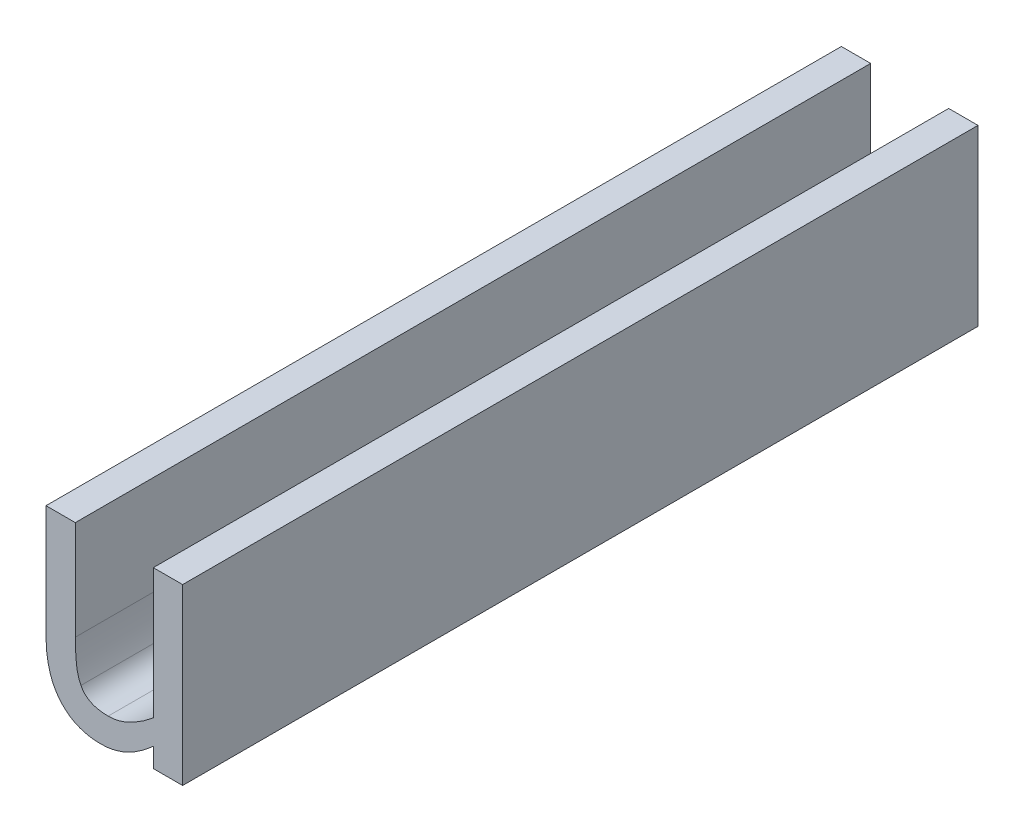
ISO-10303-21;
HEADER;
FILE_DESCRIPTION(('STEP AP214'),'2;1');
FILE_NAME('part.step','',(''),(''),'','','');
FILE_SCHEMA(('AUTOMOTIVE_DESIGN { 1 0 10303 214 1 1 1 1 }'));
ENDSEC;
DATA;
#1=APPLICATION_CONTEXT('core data for automotive mechanical design processes');
#2=APPLICATION_PROTOCOL_DEFINITION('international standard','automotive_design',2000,#1);
#3=PRODUCT_CONTEXT('',#1,'mechanical');
#4=PRODUCT('Part','Part','',(#3));
#5=PRODUCT_RELATED_PRODUCT_CATEGORY('part','',(#4));
#6=PRODUCT_DEFINITION_FORMATION('','',#4);
#7=PRODUCT_DEFINITION_CONTEXT('part definition',#1,'design');
#8=PRODUCT_DEFINITION('design','',#6,#7);
#9=PRODUCT_DEFINITION_SHAPE('','',#8);
#10=(LENGTH_UNIT() NAMED_UNIT(*) SI_UNIT(.MILLI.,.METRE.));
#11=(NAMED_UNIT(*) PLANE_ANGLE_UNIT() SI_UNIT($,.RADIAN.));
#12=(NAMED_UNIT(*) SI_UNIT($,.STERADIAN.) SOLID_ANGLE_UNIT());
#13=UNCERTAINTY_MEASURE_WITH_UNIT(LENGTH_MEASURE(1.E-05),#10,'distance_accuracy_value','');
#14=(GEOMETRIC_REPRESENTATION_CONTEXT(3) GLOBAL_UNCERTAINTY_ASSIGNED_CONTEXT((#13)) GLOBAL_UNIT_ASSIGNED_CONTEXT((#10,
#11,#12)) REPRESENTATION_CONTEXT('',''));
#15=CARTESIAN_POINT('',(0.,0.,0.));
#16=DIRECTION('',(0.,0.,1.));
#17=DIRECTION('',(1.,0.,0.));
#18=AXIS2_PLACEMENT_3D('',#15,#16,#17);
#19=CARTESIAN_POINT('',(5.132988807721,3.57537755009,0.));
#20=DIRECTION('',(0.,1.,0.));
#21=DIRECTION('',(0.,0.,1.));
#22=AXIS2_PLACEMENT_3D('',#19,#20,#21);
#23=PLANE('',#22);
#24=DIRECTION('',(1.,0.,0.));
#25=VECTOR('',#24,1.);
#26=CARTESIAN_POINT('',(5.138448572485,3.57537755009,0.1));
#27=LINE('',#26,#25);
#28=CARTESIAN_POINT('',(5.132988807721,3.57537755009,0.1));
#29=VERTEX_POINT('',#28);
#30=CARTESIAN_POINT('',(5.129302453996,3.57537755009,0.1));
#31=VERTEX_POINT('',#30);
#32=EDGE_CURVE('E290',#29,#31,#27,.F.);
#33=ORIENTED_EDGE('',*,*,#32,.F.);
#34=DIRECTION('',(0.,0.,-1.));
#35=VECTOR('',#34,1.);
#36=CARTESIAN_POINT('',(5.132988807721,3.57537755009,0.));
#37=LINE('',#36,#35);
#38=CARTESIAN_POINT('',(5.132988807721,3.57537755009,0.));
#39=VERTEX_POINT('',#38);
#40=EDGE_CURVE('E284',#39,#29,#37,.F.);
#41=ORIENTED_EDGE('',*,*,#40,.F.);
#42=DIRECTION('',(1.,0.,0.));
#43=VECTOR('',#42,1.);
#44=CARTESIAN_POINT('',(5.138448572485,3.57537755009,0.));
#45=LINE('',#44,#43);
#46=CARTESIAN_POINT('',(5.129302453996,3.57537755009,0.));
#47=VERTEX_POINT('',#46);
#48=EDGE_CURVE('E255',#39,#47,#45,.F.);
#49=ORIENTED_EDGE('',*,*,#48,.T.);
#50=DIRECTION('',(0.,0.,1.));
#51=VECTOR('',#50,1.);
#52=CARTESIAN_POINT('',(5.129302453996,3.57537755009,0.));
#53=LINE('',#52,#51);
#54=EDGE_CURVE('E296',#31,#47,#53,.F.);
#55=ORIENTED_EDGE('',*,*,#54,.F.);
#56=EDGE_LOOP('',(#33,#41,#49,#55));
#57=FACE_BOUND('',#56,.T.);
#58=ADVANCED_FACE('F17',(#57),#23,.T.);
#59=CARTESIAN_POINT('',(5.129302453996,3.57537755009,0.));
#60=DIRECTION('',(-1.,0.,0.));
#61=DIRECTION('',(0.,0.,1.));
#62=AXIS2_PLACEMENT_3D('',#59,#60,#61);
#63=PLANE('',#62);
#64=DIRECTION('',(0.,1.,0.));
#65=VECTOR('',#64,1.);
#66=CARTESIAN_POINT('',(5.129302453996,3.564120544912,0.1));
#67=LINE('',#66,#65);
#68=CARTESIAN_POINT('',(5.129302453996,3.561175636063,0.1));
#69=VERTEX_POINT('',#68);
#70=EDGE_CURVE('E293',#31,#69,#67,.F.);
#71=ORIENTED_EDGE('',*,*,#70,.F.);
#72=ORIENTED_EDGE('',*,*,#54,.T.);
#73=DIRECTION('',(0.,1.,0.));
#74=VECTOR('',#73,1.);
#75=CARTESIAN_POINT('',(5.129302453996,3.564120544912,0.));
#76=LINE('',#75,#74);
#77=CARTESIAN_POINT('',(5.129302453996,3.561175636063,0.));
#78=VERTEX_POINT('',#77);
#79=EDGE_CURVE('E118',#47,#78,#76,.F.);
#80=ORIENTED_EDGE('',*,*,#79,.T.);
#81=DIRECTION('',(0.,0.,-1.));
#82=VECTOR('',#81,1.);
#83=CARTESIAN_POINT('',(5.129302453996,3.561175636063,0.05));
#84=LINE('',#83,#82);
#85=EDGE_CURVE('E128',#69,#78,#84,.T.);
#86=ORIENTED_EDGE('',*,*,#85,.F.);
#87=EDGE_LOOP('',(#71,#72,#80,#86));
#88=FACE_BOUND('',#87,.T.);
#89=ADVANCED_FACE('F371',(#88),#63,.T.);
#90=CARTESIAN_POINT('',(5.129302453996,3.561175636063,0.));
#91=CARTESIAN_POINT('',(5.129302453996,3.561175636063,0.1));
#92=CARTESIAN_POINT('',(5.129302453996,3.557134825249,0.));
#93=CARTESIAN_POINT('',(5.129302453996,3.557134825249,0.1));
#94=CARTESIAN_POINT('',(5.132941546775,3.552881340183,0.));
#95=CARTESIAN_POINT('',(5.132941546775,3.552881340183,0.1));
#96=CARTESIAN_POINT('',(5.136155291048,3.552881340183,0.));
#97=CARTESIAN_POINT('',(5.136155291048,3.552881340183,0.1));
#98=B_SPLINE_SURFACE_WITH_KNOTS('',2,1,((#90,#91),(#92,#93),(#94,#95),(#96,#97)),.UNSPECIFIED.,
.F.,.F.,.F.,(3,1,3),(2,2),(-2.,-1.,0.),(0.,0.01),.UNSPECIFIED.);
#99=CARTESIAN_POINT('',(5.129302453996,3.561175636063,0.1));
#100=CARTESIAN_POINT('',(5.12930371119374,3.56055458030454,0.1));
#101=CARTESIAN_POINT('',(5.12933499163837,3.55992389001481,0.1));
#102=CARTESIAN_POINT('',(5.12951230763813,3.55850561337949,0.1));
#103=CARTESIAN_POINT('',(5.12968701161501,3.55772157660612,0.1));
#104=CARTESIAN_POINT('',(5.13011180367962,3.55661260737521,0.1));
#105=CARTESIAN_POINT('',(5.13027860269103,3.55625666040931,0.1));
#106=CARTESIAN_POINT('',(5.13083173349762,3.55531274969201,0.1));
#107=CARTESIAN_POINT('',(5.13128764272219,3.55476176481285,0.1));
#108=CARTESIAN_POINT('',(5.13208511764289,3.55408984745094,0.1));
#109=CARTESIAN_POINT('',(5.13236566638977,3.55389318340302,0.1));
#110=CARTESIAN_POINT('',(5.13323473102865,3.55339676221626,0.1));
#111=CARTESIAN_POINT('',(5.13386634659164,3.55317203646916,0.1));
#112=CARTESIAN_POINT('',(5.13505767659058,3.55292532100791,0.1));
#113=CARTESIAN_POINT('',(5.13561171197699,3.55287567639697,0.1));
#114=CARTESIAN_POINT('',(5.136155291048,3.552881340183,0.1));
#115=B_SPLINE_CURVE_WITH_KNOTS('',3,(#99,#100,#101,#102,#103,#104,#105,#106,#107,#108,#109,#110,
#111,#112,#113,#114),.UNSPECIFIED.,.F.,.F.,(4,2,2,2,2,2,2,4),(0.,0.00187989626495652,
0.00426669008843733,0.00544185041958465,0.00753867902056661,0.00856165204487438,
0.010539149434339,0.0121853916043969),.UNSPECIFIED.);
#116=CARTESIAN_POINT('',(5.136155291048,3.552881340183,0.1));
#117=VERTEX_POINT('',#116);
#118=EDGE_CURVE('E191',#69,#117,#115,.T.);
#119=CARTESIAN_POINT('',(5.129302453996,3.561175636063,0.));
#120=CARTESIAN_POINT('',(5.12930371119374,3.56055458030454,0.));
#121=CARTESIAN_POINT('',(5.12933499163837,3.55992389001481,0.));
#122=CARTESIAN_POINT('',(5.12951230763813,3.55850561337949,0.));
#123=CARTESIAN_POINT('',(5.12968701161501,3.55772157660612,0.));
#124=CARTESIAN_POINT('',(5.13011180367962,3.55661260737521,0.));
#125=CARTESIAN_POINT('',(5.13027860269103,3.55625666040931,0.));
#126=CARTESIAN_POINT('',(5.13083173349762,3.55531274969201,0.));
#127=CARTESIAN_POINT('',(5.13128764272219,3.55476176481285,0.));
#128=CARTESIAN_POINT('',(5.13208511764289,3.55408984745094,0.));
#129=CARTESIAN_POINT('',(5.13236566638977,3.55389318340302,0.));
#130=CARTESIAN_POINT('',(5.13323473102865,3.55339676221626,0.));
#131=CARTESIAN_POINT('',(5.13386634659164,3.55317203646916,0.));
#132=CARTESIAN_POINT('',(5.13505767659058,3.55292532100791,0.));
#133=CARTESIAN_POINT('',(5.13561171197699,3.55287567639697,0.));
#134=CARTESIAN_POINT('',(5.136155291048,3.552881340183,0.));
#135=B_SPLINE_CURVE_WITH_KNOTS('',3,(#119,#120,#121,#122,#123,#124,#125,#126,#127,#128,#129,
#130,#131,#132,#133,#134),.UNSPECIFIED.,.F.,.F.,(4,2,2,2,2,2,2,4),(0.,0.00187989626495652,
0.00426669008843733,0.00544185041958465,0.00753867902056661,0.00856165204487438,
0.010539149434339,0.0121853916043969),.UNSPECIFIED.);
#136=CARTESIAN_POINT('',(5.136155291048,3.552881340183,0.));
#137=VERTEX_POINT('',#136);
#138=EDGE_CURVE('E24',#78,#137,#135,.T.);
#139=DIRECTION('',(0.,0.,-1.));
#140=VECTOR('',#139,1.);
#141=CARTESIAN_POINT('',(5.136155291048,3.552881340183,0.05));
#142=LINE('',#141,#140);
#143=EDGE_CURVE('E126',#117,#137,#142,.T.);
#144=ORIENTED_EDGE('',*,*,#118,.F.);
#145=ORIENTED_EDGE('',*,*,#85,.T.);
#146=ORIENTED_EDGE('',*,*,#138,.T.);
#147=ORIENTED_EDGE('',*,*,#143,.F.);
#148=EDGE_LOOP('',(#144,#145,#146,#147));
#149=FACE_BOUND('',#148,.T.);
#150=ADVANCED_FACE('F125',(#149),#98,.T.);
#151=CARTESIAN_POINT('',(5.136155291048,3.552881340183,0.));
#152=CARTESIAN_POINT('',(5.136155291048,3.552881340183,0.1));
#153=CARTESIAN_POINT('',(5.137951206965,3.552881340183,0.));
#154=CARTESIAN_POINT('',(5.137951206965,3.552881340183,0.1));
#155=CARTESIAN_POINT('',(5.141141320765,3.554440951374,0.));
#156=CARTESIAN_POINT('',(5.141141320765,3.554440951374,0.1));
#157=CARTESIAN_POINT('',(5.142795453846,3.555929671147,0.));
#158=CARTESIAN_POINT('',(5.142795453846,3.555929671147,0.1));
#159=B_SPLINE_SURFACE_WITH_KNOTS('',2,1,((#151,#152),(#153,#154),(#155,#156),(#157,#158)),
.UNSPECIFIED.,.F.,.F.,.F.,(3,1,3),(2,2),(-2.,-1.,0.),(0.,0.01),.UNSPECIFIED.);
#160=CARTESIAN_POINT('',(5.136155291048,3.552881340183,0.1));
#161=CARTESIAN_POINT('',(5.13678853026826,3.55286714268251,0.1));
#162=CARTESIAN_POINT('',(5.13741442870382,3.552948742182,0.1));
#163=CARTESIAN_POINT('',(5.13862924326214,3.55326152794095,0.1));
#164=CARTESIAN_POINT('',(5.13921815738917,3.55349272226516,0.1));
#165=CARTESIAN_POINT('',(5.14033664789793,3.554062692285,0.1));
#166=CARTESIAN_POINT('',(5.14086622232563,3.55440147152194,0.1));
#167=CARTESIAN_POINT('',(5.14186685951062,3.55513425373084,0.1));
#168=CARTESIAN_POINT('',(5.14233903900896,3.55552669798045,0.1));
#169=CARTESIAN_POINT('',(5.142795453846,3.555929671147,0.1));
#170=B_SPLINE_CURVE_WITH_KNOTS('',3,(#160,#161,#162,#163,#164,#165,#166,#167,#168,#169),
.UNSPECIFIED.,.F.,.F.,(4,2,2,2,4),(0.,0.00187989657440297,0.00375989450365635,
0.00563995432227521,0.00747389016123619),.UNSPECIFIED.);
#171=CARTESIAN_POINT('',(5.142795453846,3.555929671147,0.1));
#172=VERTEX_POINT('',#171);
#173=EDGE_CURVE('E136',#117,#172,#170,.T.);
#174=CARTESIAN_POINT('',(5.136155291048,3.552881340183,0.));
#175=CARTESIAN_POINT('',(5.13678853026826,3.55286714268251,0.));
#176=CARTESIAN_POINT('',(5.13741442870382,3.552948742182,0.));
#177=CARTESIAN_POINT('',(5.13862924326214,3.55326152794095,0.));
#178=CARTESIAN_POINT('',(5.13921815738917,3.55349272226516,0.));
#179=CARTESIAN_POINT('',(5.14033664789793,3.554062692285,0.));
#180=CARTESIAN_POINT('',(5.14086622232563,3.55440147152194,0.));
#181=CARTESIAN_POINT('',(5.14186685951062,3.55513425373084,0.));
#182=CARTESIAN_POINT('',(5.14233903900896,3.55552669798045,0.));
#183=CARTESIAN_POINT('',(5.142795453846,3.555929671147,0.));
#184=B_SPLINE_CURVE_WITH_KNOTS('',3,(#174,#175,#176,#177,#178,#179,#180,#181,#182,#183),
.UNSPECIFIED.,.F.,.F.,(4,2,2,2,4),(0.,0.00187989657440297,0.00375989450365635,
0.00563995432227521,0.00747389016123619),.UNSPECIFIED.);
#185=CARTESIAN_POINT('',(5.142795453846,3.555929671147,0.));
#186=VERTEX_POINT('',#185);
#187=EDGE_CURVE('E131',#137,#186,#184,.T.);
#188=DIRECTION('',(0.,0.,1.));
#189=VECTOR('',#188,1.);
#190=CARTESIAN_POINT('',(5.142795453846,3.555929671147,0.));
#191=LINE('',#190,#189);
#192=EDGE_CURVE('E299',#172,#186,#191,.F.);
#193=ORIENTED_EDGE('',*,*,#173,.F.);
#194=ORIENTED_EDGE('',*,*,#143,.T.);
#195=ORIENTED_EDGE('',*,*,#187,.T.);
#196=ORIENTED_EDGE('',*,*,#192,.F.);
#197=EDGE_LOOP('',(#193,#194,#195,#196));
#198=FACE_BOUND('',#197,.T.);
#199=ADVANCED_FACE('F133',(#198),#159,.T.);
#200=CARTESIAN_POINT('',(5.142795453846,3.57537755009,0.));
#201=DIRECTION('',(-1.,0.,0.));
#202=DIRECTION('',(0.,0.,1.));
#203=AXIS2_PLACEMENT_3D('',#200,#201,#202);
#204=PLANE('',#203);
#205=DIRECTION('',(0.,1.,0.));
#206=VECTOR('',#205,1.);
#207=CARTESIAN_POINT('',(5.142795453846,3.564120544912,0.1));
#208=LINE('',#207,#206);
#209=CARTESIAN_POINT('',(5.142795453846,3.57537755009,0.1));
#210=VERTEX_POINT('',#209);
#211=CARTESIAN_POINT('',(5.142795453846,3.559025263057,0.1));
#212=VERTEX_POINT('',#211);
#213=EDGE_CURVE('E318',#210,#212,#208,.F.);
#214=ORIENTED_EDGE('',*,*,#213,.F.);
#215=DIRECTION('',(0.,0.,1.));
#216=VECTOR('',#215,1.);
#217=CARTESIAN_POINT('',(5.142795453846,3.57537755009,0.));
#218=LINE('',#217,#216);
#219=CARTESIAN_POINT('',(5.142795453846,3.57537755009,0.));
#220=VERTEX_POINT('',#219);
#221=EDGE_CURVE('E281',#220,#210,#218,.T.);
#222=ORIENTED_EDGE('',*,*,#221,.F.);
#223=DIRECTION('',(0.,1.,0.));
#224=VECTOR('',#223,1.);
#225=CARTESIAN_POINT('',(5.142795453846,3.564120544912,0.));
#226=LINE('',#225,#224);
#227=CARTESIAN_POINT('',(5.142795453846,3.559025263057,0.));
#228=VERTEX_POINT('',#227);
#229=EDGE_CURVE('E145',#220,#228,#226,.F.);
#230=ORIENTED_EDGE('',*,*,#229,.T.);
#231=DIRECTION('',(0.,0.,-1.));
#232=VECTOR('',#231,1.);
#233=CARTESIAN_POINT('',(5.142795453846,3.559025263057,0.05));
#234=LINE('',#233,#232);
#235=EDGE_CURVE('E138',#212,#228,#234,.T.);
#236=ORIENTED_EDGE('',*,*,#235,.F.);
#237=EDGE_LOOP('',(#214,#222,#230,#236));
#238=FACE_BOUND('',#237,.T.);
#239=ADVANCED_FACE('F167',(#238),#204,.T.);
#240=CARTESIAN_POINT('',(5.142795453846,3.559025263057,0.));
#241=CARTESIAN_POINT('',(5.142795453846,3.559025263057,0.1));
#242=CARTESIAN_POINT('',(5.141401255963,3.557843739427,0.));
#243=CARTESIAN_POINT('',(5.141401255963,3.557843739427,0.1));
#244=CARTESIAN_POINT('',(5.138494707834,3.556378650126,0.));
#245=CARTESIAN_POINT('',(5.138494707834,3.556378650126,0.1));
#246=CARTESIAN_POINT('',(5.137124140424,3.556378650126,0.));
#247=CARTESIAN_POINT('',(5.137124140424,3.556378650126,0.1));
#248=B_SPLINE_SURFACE_WITH_KNOTS('',2,1,((#240,#241),(#242,#243),(#244,#245),(#246,#247)),
.UNSPECIFIED.,.F.,.F.,.F.,(3,1,3),(2,2),(-2.,-1.,0.),(0.,0.01),.UNSPECIFIED.);
#249=CARTESIAN_POINT('',(5.142795453846,3.559025263057,0.1));
#250=CARTESIAN_POINT('',(5.14244519238062,3.55872772923515,0.1));
#251=CARTESIAN_POINT('',(5.14208309075724,3.55844482418846,0.1));
#252=CARTESIAN_POINT('',(5.14133501977179,3.55791340611258,0.1));
#253=CARTESIAN_POINT('',(5.14094907119075,3.55766486373352,0.1));
#254=CARTESIAN_POINT('',(5.14015175684747,3.55720633916023,0.1));
#255=CARTESIAN_POINT('',(5.13974034388833,3.55699643161847,0.1));
#256=CARTESIAN_POINT('',(5.13862452545305,3.55654752174504,0.1));
#257=CARTESIAN_POINT('',(5.13789695304588,3.5563715318818,0.1));
#258=CARTESIAN_POINT('',(5.137124140424,3.556378650126,0.1));
#259=B_SPLINE_CURVE_WITH_KNOTS('',3,(#249,#250,#251,#252,#253,#254,#255,#256,#257,#258),
.UNSPECIFIED.,.F.,.F.,(4,2,2,2,4),(0.,0.0013772330628118,0.00275328243786522,
0.00413196340457667,0.00636758689292962),.UNSPECIFIED.);
#260=CARTESIAN_POINT('',(5.137124140424,3.556378650126,0.1));
#261=VERTEX_POINT('',#260);
#262=EDGE_CURVE('E192',#212,#261,#259,.T.);
#263=CARTESIAN_POINT('',(5.142795453846,3.559025263057,0.));
#264=CARTESIAN_POINT('',(5.14244519238062,3.55872772923515,0.));
#265=CARTESIAN_POINT('',(5.14208309075724,3.55844482418846,0.));
#266=CARTESIAN_POINT('',(5.14133501977179,3.55791340611258,0.));
#267=CARTESIAN_POINT('',(5.14094907119075,3.55766486373352,0.));
#268=CARTESIAN_POINT('',(5.14015175684747,3.55720633916023,0.));
#269=CARTESIAN_POINT('',(5.13974034388833,3.55699643161847,0.));
#270=CARTESIAN_POINT('',(5.13862452545305,3.55654752174504,0.));
#271=CARTESIAN_POINT('',(5.13789695304588,3.5563715318818,0.));
#272=CARTESIAN_POINT('',(5.137124140424,3.556378650126,0.));
#273=B_SPLINE_CURVE_WITH_KNOTS('',3,(#263,#264,#265,#266,#267,#268,#269,#270,#271,#272),
.UNSPECIFIED.,.F.,.F.,(4,2,2,2,4),(0.,0.0013772330628118,0.00275328243786522,
0.00413196340457667,0.00636758689292962),.UNSPECIFIED.);
#274=CARTESIAN_POINT('',(5.137124140424,3.556378650126,0.));
#275=VERTEX_POINT('',#274);
#276=EDGE_CURVE('E153',#228,#275,#273,.T.);
#277=DIRECTION('',(0.,0.,-1.));
#278=VECTOR('',#277,1.);
#279=CARTESIAN_POINT('',(5.137124140424,3.556378650126,0.05));
#280=LINE('',#279,#278);
#281=EDGE_CURVE('E325',#261,#275,#280,.T.);
#282=ORIENTED_EDGE('',*,*,#262,.F.);
#283=ORIENTED_EDGE('',*,*,#235,.T.);
#284=ORIENTED_EDGE('',*,*,#276,.T.);
#285=ORIENTED_EDGE('',*,*,#281,.F.);
#286=EDGE_LOOP('',(#282,#283,#284,#285));
#287=FACE_BOUND('',#286,.T.);
#288=ADVANCED_FACE('F172',(#287),#248,.T.);
#289=CARTESIAN_POINT('',(5.137124140424,3.556378650126,0.));
#290=CARTESIAN_POINT('',(5.137124140424,3.556378650126,0.1));
#291=CARTESIAN_POINT('',(5.135753573014,3.556378650126,0.));
#292=CARTESIAN_POINT('',(5.135753573014,3.556378650126,0.1));
#293=CARTESIAN_POINT('',(5.134146700877,3.557182086195,0.));
#294=CARTESIAN_POINT('',(5.134146700877,3.557182086195,0.1));
#295=CARTESIAN_POINT('',(5.133697721898,3.558009152735,0.));
#296=CARTESIAN_POINT('',(5.133697721898,3.558009152735,0.1));
#297=B_SPLINE_SURFACE_WITH_KNOTS('',2,1,((#289,#290),(#291,#292),(#293,#294),(#295,#296)),
.UNSPECIFIED.,.F.,.F.,.F.,(3,1,3),(2,2),(-2.,-1.,0.),(0.,0.01),.UNSPECIFIED.);
#298=CARTESIAN_POINT('',(5.137124140424,3.556378650126,0.1));
#299=CARTESIAN_POINT('',(5.13667358884304,3.55636709332848,0.1));
#300=CARTESIAN_POINT('',(5.13619540544661,3.55640332720978,0.1));
#301=CARTESIAN_POINT('',(5.13538846766422,3.55659311451495,0.1));
#302=CARTESIAN_POINT('',(5.13505124464535,3.55671667754426,0.1));
#303=CARTESIAN_POINT('',(5.13430743322107,3.55714566300273,0.1));
#304=CARTESIAN_POINT('',(5.13393649384337,3.55750746239232,0.1));
#305=CARTESIAN_POINT('',(5.133697721898,3.558009152735,0.1));
#306=B_SPLINE_CURVE_WITH_KNOTS('',3,(#298,#299,#300,#301,#302,#303,#304,#305),.UNSPECIFIED.,.F.,
.F.,(4,2,2,4),(0.,0.00139303844047665,0.00245436902179683,0.0039867848779766),.UNSPECIFIED.);
#307=CARTESIAN_POINT('',(5.133697721898,3.558009152735,0.1));
#308=VERTEX_POINT('',#307);
#309=EDGE_CURVE('E221',#261,#308,#306,.T.);
#310=CARTESIAN_POINT('',(5.137124140424,3.556378650126,0.));
#311=CARTESIAN_POINT('',(5.13667358884304,3.55636709332848,0.));
#312=CARTESIAN_POINT('',(5.13619540544661,3.55640332720978,0.));
#313=CARTESIAN_POINT('',(5.13538846766422,3.55659311451495,0.));
#314=CARTESIAN_POINT('',(5.13505124464535,3.55671667754426,0.));
#315=CARTESIAN_POINT('',(5.13430743322107,3.55714566300273,0.));
#316=CARTESIAN_POINT('',(5.13393649384337,3.55750746239232,0.));
#317=CARTESIAN_POINT('',(5.133697721898,3.558009152735,0.));
#318=B_SPLINE_CURVE_WITH_KNOTS('',3,(#310,#311,#312,#313,#314,#315,#316,#317),.UNSPECIFIED.,.F.,
.F.,(4,2,2,4),(0.,0.00139303844047665,0.00245436902179683,0.0039867848779766),.UNSPECIFIED.);
#319=CARTESIAN_POINT('',(5.133697721898,3.558009152735,0.));
#320=VERTEX_POINT('',#319);
#321=EDGE_CURVE('E239',#275,#320,#318,.T.);
#322=DIRECTION('',(0.,0.,-1.));
#323=VECTOR('',#322,1.);
#324=CARTESIAN_POINT('',(5.133697721898,3.558009152735,0.05));
#325=LINE('',#324,#323);
#326=EDGE_CURVE('E287',#308,#320,#325,.T.);
#327=ORIENTED_EDGE('',*,*,#309,.F.);
#328=ORIENTED_EDGE('',*,*,#281,.T.);
#329=ORIENTED_EDGE('',*,*,#321,.T.);
#330=ORIENTED_EDGE('',*,*,#326,.F.);
#331=EDGE_LOOP('',(#327,#328,#329,#330));
#332=FACE_BOUND('',#331,.T.);
#333=ADVANCED_FACE('F227',(#332),#297,.T.);
#334=CARTESIAN_POINT('',(5.133697721898,3.558009152735,0.));
#335=CARTESIAN_POINT('',(5.133697721898,3.558009152735,0.1));
#336=CARTESIAN_POINT('',(5.133272373392,3.558788958331,0.));
#337=CARTESIAN_POINT('',(5.133272373392,3.558788958331,0.1));
#338=CARTESIAN_POINT('',(5.132988807721,3.561388310316,0.));
#339=CARTESIAN_POINT('',(5.132988807721,3.561388310316,0.1));
#340=CARTESIAN_POINT('',(5.132988807721,3.562900660562,0.));
#341=CARTESIAN_POINT('',(5.132988807721,3.562900660562,0.1));
#342=B_SPLINE_SURFACE_WITH_KNOTS('',2,1,((#334,#335),(#336,#337),(#338,#339),(#340,#341)),
.UNSPECIFIED.,.F.,.F.,.F.,(3,1,3),(2,2),(-2.,-1.,0.),(0.,0.01),.UNSPECIFIED.);
#343=CARTESIAN_POINT('',(5.133697721898,3.558009152735,0.1));
#344=CARTESIAN_POINT('',(5.13350990597719,3.55836759859004,0.1));
#345=CARTESIAN_POINT('',(5.1333813897563,3.55874331963218,0.1));
#346=CARTESIAN_POINT('',(5.13316888410804,3.55964116543192,0.1));
#347=CARTESIAN_POINT('',(5.13311366025217,3.56017062737246,0.1));
#348=CARTESIAN_POINT('',(5.13304214987287,3.56109465479451,0.1));
#349=CARTESIAN_POINT('',(5.13301957885176,3.56148983401523,0.1));
#350=CARTESIAN_POINT('',(5.13299362819012,3.56222329852457,0.1));
#351=CARTESIAN_POINT('',(5.13298793150218,3.56256148414579,0.1));
#352=CARTESIAN_POINT('',(5.132988807721,3.562900660562,0.1));
#353=B_SPLINE_CURVE_WITH_KNOTS('',3,(#343,#344,#345,#346,#347,#348,#349,#350,#351,#352),
.UNSPECIFIED.,.F.,.F.,(4,2,2,2,4),(0.,0.00119127993804618,0.00277638468230773,
0.00396498136241607,0.00498039838102392),.UNSPECIFIED.);
#354=CARTESIAN_POINT('',(5.132988807721,3.562900660562,0.1));
#355=VERTEX_POINT('',#354);
#356=EDGE_CURVE('E215',#308,#355,#353,.T.);
#357=CARTESIAN_POINT('',(5.133697721898,3.558009152735,0.));
#358=CARTESIAN_POINT('',(5.13350990597719,3.55836759859004,0.));
#359=CARTESIAN_POINT('',(5.1333813897563,3.55874331963218,0.));
#360=CARTESIAN_POINT('',(5.13316888410804,3.55964116543192,0.));
#361=CARTESIAN_POINT('',(5.13311366025217,3.56017062737246,0.));
#362=CARTESIAN_POINT('',(5.13304214987287,3.56109465479451,0.));
#363=CARTESIAN_POINT('',(5.13301957885176,3.56148983401523,0.));
#364=CARTESIAN_POINT('',(5.13299362819012,3.56222329852457,0.));
#365=CARTESIAN_POINT('',(5.13298793150218,3.56256148414579,0.));
#366=CARTESIAN_POINT('',(5.132988807721,3.562900660562,0.));
#367=B_SPLINE_CURVE_WITH_KNOTS('',3,(#357,#358,#359,#360,#361,#362,#363,#364,#365,#366),
.UNSPECIFIED.,.F.,.F.,(4,2,2,2,4),(0.,0.00119127993804618,0.00277638468230773,
0.00396498136241607,0.00498039838102392),.UNSPECIFIED.);
#368=CARTESIAN_POINT('',(5.132988807721,3.562900660562,0.));
#369=VERTEX_POINT('',#368);
#370=EDGE_CURVE('E244',#320,#369,#367,.T.);
#371=DIRECTION('',(0.,0.,-1.));
#372=VECTOR('',#371,1.);
#373=CARTESIAN_POINT('',(5.132988807721,3.562900660562,0.));
#374=LINE('',#373,#372);
#375=EDGE_CURVE('E286',#355,#369,#374,.T.);
#376=ORIENTED_EDGE('',*,*,#356,.F.);
#377=ORIENTED_EDGE('',*,*,#326,.T.);
#378=ORIENTED_EDGE('',*,*,#370,.T.);
#379=ORIENTED_EDGE('',*,*,#375,.F.);
#380=EDGE_LOOP('',(#376,#377,#378,#379));
#381=FACE_BOUND('',#380,.T.);
#382=ADVANCED_FACE('F19',(#381),#342,.T.);
#383=CARTESIAN_POINT('',(5.132988807721,3.562900660562,0.));
#384=DIRECTION('',(1.,0.,0.));
#385=DIRECTION('',(0.,0.,-1.));
#386=AXIS2_PLACEMENT_3D('',#383,#384,#385);
#387=PLANE('',#386);
#388=DIRECTION('',(0.,1.,0.));
#389=VECTOR('',#388,1.);
#390=CARTESIAN_POINT('',(5.132988807721,3.564120544912,0.1));
#391=LINE('',#390,#389);
#392=EDGE_CURVE('E331',#355,#29,#391,.T.);
#393=ORIENTED_EDGE('',*,*,#392,.F.);
#394=ORIENTED_EDGE('',*,*,#375,.T.);
#395=DIRECTION('',(0.,1.,0.));
#396=VECTOR('',#395,1.);
#397=CARTESIAN_POINT('',(5.132988807721,3.564120544912,0.));
#398=LINE('',#397,#396);
#399=EDGE_CURVE('E249',#369,#39,#398,.T.);
#400=ORIENTED_EDGE('',*,*,#399,.T.);
#401=ORIENTED_EDGE('',*,*,#40,.T.);
#402=EDGE_LOOP('',(#393,#394,#400,#401));
#403=FACE_BOUND('',#402,.T.);
#404=ADVANCED_FACE('F368',(#403),#387,.T.);
#405=CARTESIAN_POINT('',(5.142795453846,3.555929671147,0.));
#406=DIRECTION('',(-1.,0.,0.));
#407=DIRECTION('',(0.,0.,1.));
#408=AXIS2_PLACEMENT_3D('',#405,#406,#407);
#409=PLANE('',#408);
#410=DIRECTION('',(0.,1.,0.));
#411=VECTOR('',#410,1.);
#412=CARTESIAN_POINT('',(5.142795453846,3.564120544912,0.1));
#413=LINE('',#412,#411);
#414=CARTESIAN_POINT('',(5.142795453846,3.55349573247,0.1));
#415=VERTEX_POINT('',#414);
#416=EDGE_CURVE('E190',#172,#415,#413,.F.);
#417=ORIENTED_EDGE('',*,*,#416,.F.);
#418=ORIENTED_EDGE('',*,*,#192,.T.);
#419=DIRECTION('',(0.,1.,0.));
#420=VECTOR('',#419,1.);
#421=CARTESIAN_POINT('',(5.142795453846,3.564120544912,0.));
#422=LINE('',#421,#420);
#423=CARTESIAN_POINT('',(5.142795453846,3.55349573247,0.));
#424=VERTEX_POINT('',#423);
#425=EDGE_CURVE('E144',#186,#424,#422,.F.);
#426=ORIENTED_EDGE('',*,*,#425,.T.);
#427=DIRECTION('',(0.,0.,-1.));
#428=VECTOR('',#427,1.);
#429=CARTESIAN_POINT('',(5.142795453846,3.55349573247,0.));
#430=LINE('',#429,#428);
#431=EDGE_CURVE('E273',#415,#424,#430,.T.);
#432=ORIENTED_EDGE('',*,*,#431,.F.);
#433=EDGE_LOOP('',(#417,#418,#426,#432));
#434=FACE_BOUND('',#433,.T.);
#435=ADVANCED_FACE('F351',(#434),#409,.T.);
#436=CARTESIAN_POINT('',(5.138448572485,3.564120544912,0.));
#437=DIRECTION('',(0.,0.,1.));
#438=DIRECTION('',(1.,0.,0.));
#439=AXIS2_PLACEMENT_3D('',#436,#437,#438);
#440=PLANE('',#439);
#441=ORIENTED_EDGE('',*,*,#399,.F.);
#442=ORIENTED_EDGE('',*,*,#370,.F.);
#443=ORIENTED_EDGE('',*,*,#321,.F.);
#444=ORIENTED_EDGE('',*,*,#276,.F.);
#445=ORIENTED_EDGE('',*,*,#229,.F.);
#446=DIRECTION('',(1.,0.,0.));
#447=VECTOR('',#446,1.);
#448=CARTESIAN_POINT('',(5.14648180757,3.57537755009,0.));
#449=LINE('',#448,#447);
#450=CARTESIAN_POINT('',(5.14648180757,3.57537755009,0.));
#451=VERTEX_POINT('',#450);
#452=EDGE_CURVE('E261',#451,#220,#449,.F.);
#453=ORIENTED_EDGE('',*,*,#452,.F.);
#454=DIRECTION('',(0.,1.,0.));
#455=VECTOR('',#454,1.);
#456=CARTESIAN_POINT('',(5.14648180757,3.55349573247,0.));
#457=LINE('',#456,#455);
#458=CARTESIAN_POINT('',(5.14648180757,3.55349573247,0.));
#459=VERTEX_POINT('',#458);
#460=EDGE_CURVE('E269',#459,#451,#457,.T.);
#461=ORIENTED_EDGE('',*,*,#460,.F.);
#462=DIRECTION('',(1.,0.,0.));
#463=VECTOR('',#462,1.);
#464=CARTESIAN_POINT('',(5.142795453846,3.55349573247,0.));
#465=LINE('',#464,#463);
#466=EDGE_CURVE('E334',#424,#459,#465,.T.);
#467=ORIENTED_EDGE('',*,*,#466,.F.);
#468=ORIENTED_EDGE('',*,*,#425,.F.);
#469=ORIENTED_EDGE('',*,*,#187,.F.);
#470=ORIENTED_EDGE('',*,*,#138,.F.);
#471=ORIENTED_EDGE('',*,*,#79,.F.);
#472=ORIENTED_EDGE('',*,*,#48,.F.);
#473=EDGE_LOOP('',(#441,#442,#443,#444,#445,#453,#461,#467,#468,#469,#470,#471,#472));
#474=FACE_BOUND('',#473,.T.);
#475=ADVANCED_FACE('F142',(#474),#440,.F.);
#476=CARTESIAN_POINT('',(5.14648180757,3.57537755009,0.));
#477=DIRECTION('',(0.,1.,0.));
#478=DIRECTION('',(0.,0.,1.));
#479=AXIS2_PLACEMENT_3D('',#476,#477,#478);
#480=PLANE('',#479);
#481=DIRECTION('',(1.,0.,0.));
#482=VECTOR('',#481,1.);
#483=CARTESIAN_POINT('',(5.138448572485,3.57537755009,0.1));
#484=LINE('',#483,#482);
#485=CARTESIAN_POINT('',(5.14648180757,3.57537755009,0.1));
#486=VERTEX_POINT('',#485);
#487=EDGE_CURVE('E301',#486,#210,#484,.F.);
#488=ORIENTED_EDGE('',*,*,#487,.F.);
#489=DIRECTION('',(0.,0.,-1.));
#490=VECTOR('',#489,1.);
#491=CARTESIAN_POINT('',(5.14648180757,3.57537755009,0.));
#492=LINE('',#491,#490);
#493=EDGE_CURVE('E272',#451,#486,#492,.F.);
#494=ORIENTED_EDGE('',*,*,#493,.F.);
#495=ORIENTED_EDGE('',*,*,#452,.T.);
#496=ORIENTED_EDGE('',*,*,#221,.T.);
#497=EDGE_LOOP('',(#488,#494,#495,#496));
#498=FACE_BOUND('',#497,.T.);
#499=ADVANCED_FACE('F208',(#498),#480,.T.);
#500=CARTESIAN_POINT('',(5.138448572485,3.564120544912,0.1));
#501=DIRECTION('',(0.,0.,1.));
#502=DIRECTION('',(1.,0.,0.));
#503=AXIS2_PLACEMENT_3D('',#500,#501,#502);
#504=PLANE('',#503);
#505=ORIENTED_EDGE('',*,*,#356,.T.);
#506=ORIENTED_EDGE('',*,*,#392,.T.);
#507=ORIENTED_EDGE('',*,*,#32,.T.);
#508=ORIENTED_EDGE('',*,*,#70,.T.);
#509=ORIENTED_EDGE('',*,*,#118,.T.);
#510=ORIENTED_EDGE('',*,*,#173,.T.);
#511=ORIENTED_EDGE('',*,*,#416,.T.);
#512=DIRECTION('',(1.,0.,0.));
#513=VECTOR('',#512,1.);
#514=CARTESIAN_POINT('',(5.142795453846,3.55349573247,0.1));
#515=LINE('',#514,#513);
#516=CARTESIAN_POINT('',(5.14648180757,3.55349573247,0.1));
#517=VERTEX_POINT('',#516);
#518=EDGE_CURVE('E45',#517,#415,#515,.F.);
#519=ORIENTED_EDGE('',*,*,#518,.F.);
#520=DIRECTION('',(0.,1.,0.));
#521=VECTOR('',#520,1.);
#522=CARTESIAN_POINT('',(5.14648180757,3.55349573247,0.1));
#523=LINE('',#522,#521);
#524=EDGE_CURVE('E36',#486,#517,#523,.F.);
#525=ORIENTED_EDGE('',*,*,#524,.F.);
#526=ORIENTED_EDGE('',*,*,#487,.T.);
#527=ORIENTED_EDGE('',*,*,#213,.T.);
#528=ORIENTED_EDGE('',*,*,#262,.T.);
#529=ORIENTED_EDGE('',*,*,#309,.T.);
#530=EDGE_LOOP('',(#505,#506,#507,#508,#509,#510,#511,#519,#525,#526,#527,#528,#529));
#531=FACE_BOUND('',#530,.T.);
#532=ADVANCED_FACE('F203',(#531),#504,.T.);
#533=CARTESIAN_POINT('',(5.142795453846,3.55349573247,0.));
#534=DIRECTION('',(0.,-1.,0.));
#535=DIRECTION('',(0.,0.,-1.));
#536=AXIS2_PLACEMENT_3D('',#533,#534,#535);
#537=PLANE('',#536);
#538=ORIENTED_EDGE('',*,*,#518,.T.);
#539=ORIENTED_EDGE('',*,*,#431,.T.);
#540=ORIENTED_EDGE('',*,*,#466,.T.);
#541=DIRECTION('',(0.,0.,-1.));
#542=VECTOR('',#541,1.);
#543=CARTESIAN_POINT('',(5.14648180757,3.55349573247,0.));
#544=LINE('',#543,#542);
#545=EDGE_CURVE('E11',#517,#459,#544,.T.);
#546=ORIENTED_EDGE('',*,*,#545,.F.);
#547=EDGE_LOOP('',(#538,#539,#540,#546));
#548=FACE_BOUND('',#547,.T.);
#549=ADVANCED_FACE('F207',(#548),#537,.T.);
#550=CARTESIAN_POINT('',(5.14648180757,3.55349573247,0.));
#551=DIRECTION('',(1.,0.,0.));
#552=DIRECTION('',(0.,0.,-1.));
#553=AXIS2_PLACEMENT_3D('',#550,#551,#552);
#554=PLANE('',#553);
#555=ORIENTED_EDGE('',*,*,#524,.T.);
#556=ORIENTED_EDGE('',*,*,#545,.T.);
#557=ORIENTED_EDGE('',*,*,#460,.T.);
#558=ORIENTED_EDGE('',*,*,#493,.T.);
#559=EDGE_LOOP('',(#555,#556,#557,#558));
#560=FACE_BOUND('',#559,.T.);
#561=ADVANCED_FACE('F354',(#560),#554,.T.);
#562=CLOSED_SHELL('',(#58,#89,#150,#199,#239,#288,#333,#382,#404,#435,#475,#499,#532,#549,#561));
#563=MANIFOLD_SOLID_BREP('B1',#562);
#564=ADVANCED_BREP_SHAPE_REPRESENTATION('',(#18,#563),#14);
#565=SHAPE_DEFINITION_REPRESENTATION(#9,#564);
ENDSEC;
END-ISO-10303-21;
